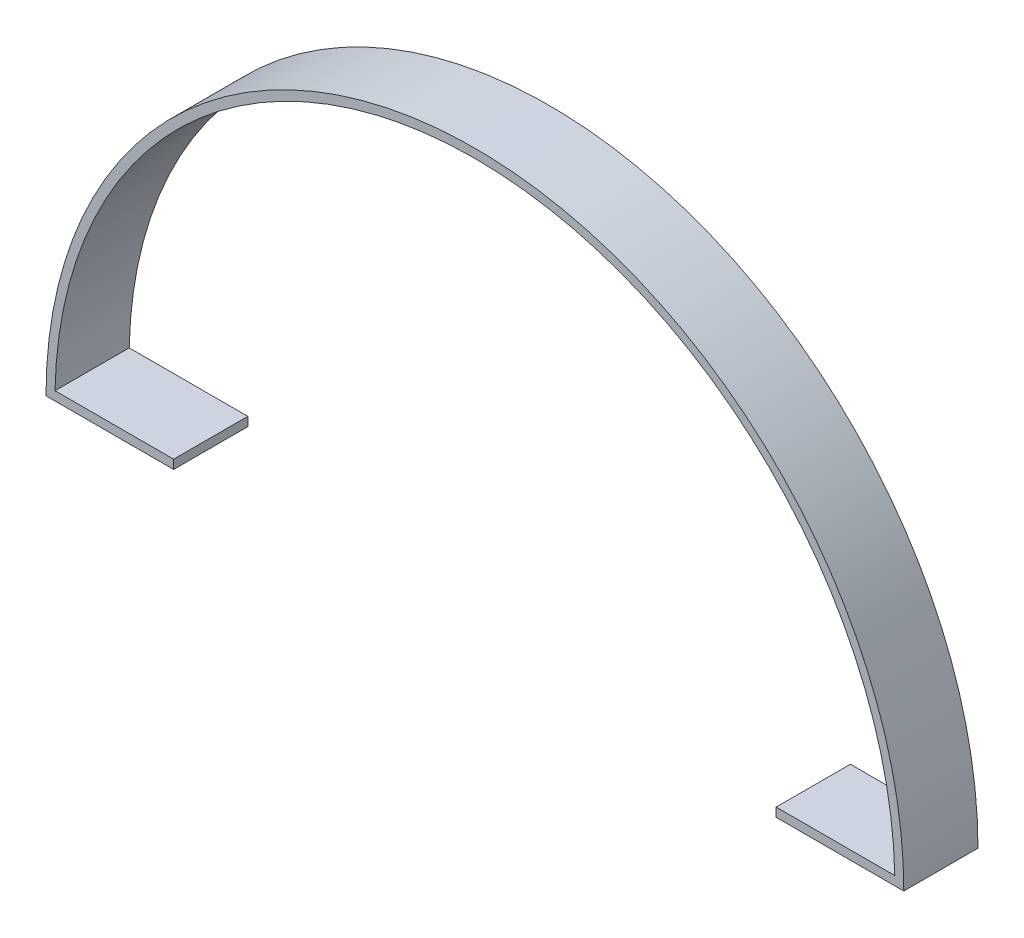
ISO-10303-21;
HEADER;
FILE_DESCRIPTION(('STEP AP214'),'2;1');
FILE_NAME('part.step','',(''),(''),'','','');
FILE_SCHEMA(('AUTOMOTIVE_DESIGN { 1 0 10303 214 1 1 1 1 }'));
ENDSEC;
DATA;
#1=APPLICATION_CONTEXT('core data for automotive mechanical design processes');
#2=APPLICATION_PROTOCOL_DEFINITION('international standard','automotive_design',2000,#1);
#3=PRODUCT_CONTEXT('',#1,'mechanical');
#4=PRODUCT('Part','Part','',(#3));
#5=PRODUCT_RELATED_PRODUCT_CATEGORY('part','',(#4));
#6=PRODUCT_DEFINITION_FORMATION('','',#4);
#7=PRODUCT_DEFINITION_CONTEXT('part definition',#1,'design');
#8=PRODUCT_DEFINITION('design','',#6,#7);
#9=PRODUCT_DEFINITION_SHAPE('','',#8);
#10=(LENGTH_UNIT() NAMED_UNIT(*) SI_UNIT(.MILLI.,.METRE.));
#11=(NAMED_UNIT(*) PLANE_ANGLE_UNIT() SI_UNIT($,.RADIAN.));
#12=(NAMED_UNIT(*) SI_UNIT($,.STERADIAN.) SOLID_ANGLE_UNIT());
#13=UNCERTAINTY_MEASURE_WITH_UNIT(LENGTH_MEASURE(1.E-05),#10,'distance_accuracy_value','');
#14=(GEOMETRIC_REPRESENTATION_CONTEXT(3) GLOBAL_UNCERTAINTY_ASSIGNED_CONTEXT((#13)) GLOBAL_UNIT_ASSIGNED_CONTEXT((#10,
#11,#12)) REPRESENTATION_CONTEXT('',''));
#15=CARTESIAN_POINT('',(0.,0.,0.));
#16=DIRECTION('',(0.,0.,1.));
#17=DIRECTION('',(1.,0.,0.));
#18=AXIS2_PLACEMENT_3D('',#15,#16,#17);
#19=CARTESIAN_POINT('',(289.,3.,25.));
#20=DIRECTION('',(0.,-1.,0.));
#21=DIRECTION('',(1.,0.,0.));
#22=AXIS2_PLACEMENT_3D('',#19,#20,#21);
#23=PLANE('',#22);
#24=DIRECTION('',(-1.,0.,0.));
#25=VECTOR('',#24,1.);
#26=CARTESIAN_POINT('',(289.,3.,0.));
#27=LINE('',#26,#25);
#28=CARTESIAN_POINT('',(285.968194305293,3.,0.));
#29=VERTEX_POINT('',#28);
#30=CARTESIAN_POINT('',(246.,3.,0.));
#31=VERTEX_POINT('',#30);
#32=EDGE_CURVE('E130',#29,#31,#27,.T.);
#33=ORIENTED_EDGE('',*,*,#32,.T.);
#34=DIRECTION('',(0.,0.,-1.));
#35=VECTOR('',#34,1.);
#36=CARTESIAN_POINT('',(246.,3.,25.));
#37=LINE('',#36,#35);
#38=CARTESIAN_POINT('',(246.,3.,25.));
#39=VERTEX_POINT('',#38);
#40=EDGE_CURVE('E11',#39,#31,#37,.T.);
#41=ORIENTED_EDGE('',*,*,#40,.F.);
#42=DIRECTION('',(-1.,0.,0.));
#43=VECTOR('',#42,1.);
#44=CARTESIAN_POINT('',(289.,3.,25.));
#45=LINE('',#44,#43);
#46=CARTESIAN_POINT('',(285.968194305293,3.,25.));
#47=VERTEX_POINT('',#46);
#48=EDGE_CURVE('E88',#47,#39,#45,.T.);
#49=ORIENTED_EDGE('',*,*,#48,.F.);
#50=DIRECTION('',(0.,0.,-1.));
#51=VECTOR('',#50,1.);
#52=CARTESIAN_POINT('',(285.968194305293,3.,25.));
#53=LINE('',#52,#51);
#54=EDGE_CURVE('E129',#47,#29,#53,.T.);
#55=ORIENTED_EDGE('',*,*,#54,.T.);
#56=EDGE_LOOP('',(#33,#41,#49,#55));
#57=FACE_BOUND('',#56,.T.);
#58=ADVANCED_FACE('F33',(#57),#23,.F.);
#59=CARTESIAN_POINT('',(246.,0.,25.));
#60=DIRECTION('',(-1.,0.,0.));
#61=DIRECTION('',(0.,0.,1.));
#62=AXIS2_PLACEMENT_3D('',#59,#60,#61);
#63=PLANE('',#62);
#64=DIRECTION('',(0.,1.,0.));
#65=VECTOR('',#64,1.);
#66=CARTESIAN_POINT('',(246.,0.,0.));
#67=LINE('',#66,#65);
#68=CARTESIAN_POINT('',(246.,0.,0.));
#69=VERTEX_POINT('',#68);
#70=EDGE_CURVE('E133',#69,#31,#67,.T.);
#71=ORIENTED_EDGE('',*,*,#70,.F.);
#72=DIRECTION('',(0.,0.,-1.));
#73=VECTOR('',#72,1.);
#74=CARTESIAN_POINT('',(246.,0.,25.));
#75=LINE('',#74,#73);
#76=CARTESIAN_POINT('',(246.,0.,25.));
#77=VERTEX_POINT('',#76);
#78=EDGE_CURVE('E41',#77,#69,#75,.T.);
#79=ORIENTED_EDGE('',*,*,#78,.F.);
#80=DIRECTION('',(0.,1.,0.));
#81=VECTOR('',#80,1.);
#82=CARTESIAN_POINT('',(246.,0.,25.));
#83=LINE('',#82,#81);
#84=EDGE_CURVE('E172',#77,#39,#83,.T.);
#85=ORIENTED_EDGE('',*,*,#84,.T.);
#86=ORIENTED_EDGE('',*,*,#40,.T.);
#87=EDGE_LOOP('',(#71,#79,#85,#86));
#88=FACE_BOUND('',#87,.T.);
#89=ADVANCED_FACE('F163',(#88),#63,.T.);
#90=CARTESIAN_POINT('',(289.,0.,25.));
#91=DIRECTION('',(0.,-1.,0.));
#92=DIRECTION('',(1.,0.,0.));
#93=AXIS2_PLACEMENT_3D('',#90,#91,#92);
#94=PLANE('',#93);
#95=DIRECTION('',(-1.,0.,0.));
#96=VECTOR('',#95,1.);
#97=CARTESIAN_POINT('',(289.,0.,0.));
#98=LINE('',#97,#96);
#99=CARTESIAN_POINT('',(289.,0.,0.));
#100=VERTEX_POINT('',#99);
#101=EDGE_CURVE('E136',#100,#69,#98,.T.);
#102=ORIENTED_EDGE('',*,*,#101,.F.);
#103=DIRECTION('',(0.,0.,-1.));
#104=VECTOR('',#103,1.);
#105=CARTESIAN_POINT('',(289.,0.,25.));
#106=LINE('',#105,#104);
#107=CARTESIAN_POINT('',(289.,0.,25.));
#108=VERTEX_POINT('',#107);
#109=EDGE_CURVE('E153',#108,#100,#106,.T.);
#110=ORIENTED_EDGE('',*,*,#109,.F.);
#111=DIRECTION('',(-1.,0.,0.));
#112=VECTOR('',#111,1.);
#113=CARTESIAN_POINT('',(289.,0.,25.));
#114=LINE('',#113,#112);
#115=EDGE_CURVE('E160',#108,#77,#114,.T.);
#116=ORIENTED_EDGE('',*,*,#115,.T.);
#117=ORIENTED_EDGE('',*,*,#78,.T.);
#118=EDGE_LOOP('',(#102,#110,#116,#117));
#119=FACE_BOUND('',#118,.T.);
#120=ADVANCED_FACE('F158',(#119),#94,.T.);
#121=CARTESIAN_POINT('',(144.5,0.,25.));
#122=DIRECTION('',(0.,0.,-1.));
#123=DIRECTION('',(-1.,0.,0.));
#124=AXIS2_PLACEMENT_3D('',#121,#122,#123);
#125=CYLINDRICAL_SURFACE('',#124,144.5);
#126=CARTESIAN_POINT('',(144.5,0.,0.));
#127=DIRECTION('',(0.,0.,-1.));
#128=DIRECTION('',(-1.,0.,0.));
#129=AXIS2_PLACEMENT_3D('',#126,#127,#128);
#130=CIRCLE('',#129,144.5);
#131=CARTESIAN_POINT('',(0.,0.,0.));
#132=VERTEX_POINT('',#131);
#133=EDGE_CURVE('E139',#132,#100,#130,.T.);
#134=ORIENTED_EDGE('',*,*,#133,.F.);
#135=DIRECTION('',(0.,0.,-1.));
#136=VECTOR('',#135,1.);
#137=CARTESIAN_POINT('',(0.,0.,25.));
#138=LINE('',#137,#136);
#139=CARTESIAN_POINT('',(0.,0.,25.));
#140=VERTEX_POINT('',#139);
#141=EDGE_CURVE('E151',#140,#132,#138,.T.);
#142=ORIENTED_EDGE('',*,*,#141,.F.);
#143=CARTESIAN_POINT('',(144.5,0.,25.));
#144=DIRECTION('',(0.,0.,-1.));
#145=DIRECTION('',(-1.,0.,0.));
#146=AXIS2_PLACEMENT_3D('',#143,#144,#145);
#147=CIRCLE('',#146,144.5);
#148=EDGE_CURVE('E124',#140,#108,#147,.T.);
#149=ORIENTED_EDGE('',*,*,#148,.T.);
#150=ORIENTED_EDGE('',*,*,#109,.T.);
#151=EDGE_LOOP('',(#134,#142,#149,#150));
#152=FACE_BOUND('',#151,.T.);
#153=ADVANCED_FACE('F170',(#152),#125,.T.);
#154=CARTESIAN_POINT('',(0.,0.,25.));
#155=DIRECTION('',(0.,-1.,0.));
#156=DIRECTION('',(0.,0.,-1.));
#157=AXIS2_PLACEMENT_3D('',#154,#155,#156);
#158=PLANE('',#157);
#159=DIRECTION('',(-1.,0.,0.));
#160=VECTOR('',#159,1.);
#161=CARTESIAN_POINT('',(0.,0.,0.));
#162=LINE('',#161,#160);
#163=CARTESIAN_POINT('',(43.,0.,0.));
#164=VERTEX_POINT('',#163);
#165=EDGE_CURVE('E142',#164,#132,#162,.T.);
#166=ORIENTED_EDGE('',*,*,#165,.F.);
#167=DIRECTION('',(0.,0.,-1.));
#168=VECTOR('',#167,1.);
#169=CARTESIAN_POINT('',(43.,0.,25.));
#170=LINE('',#169,#168);
#171=CARTESIAN_POINT('',(43.,0.,25.));
#172=VERTEX_POINT('',#171);
#173=EDGE_CURVE('E112',#172,#164,#170,.T.);
#174=ORIENTED_EDGE('',*,*,#173,.F.);
#175=DIRECTION('',(-1.,0.,0.));
#176=VECTOR('',#175,1.);
#177=CARTESIAN_POINT('',(0.,0.,25.));
#178=LINE('',#177,#176);
#179=EDGE_CURVE('E122',#172,#140,#178,.T.);
#180=ORIENTED_EDGE('',*,*,#179,.T.);
#181=ORIENTED_EDGE('',*,*,#141,.T.);
#182=EDGE_LOOP('',(#166,#174,#180,#181));
#183=FACE_BOUND('',#182,.T.);
#184=ADVANCED_FACE('F177',(#183),#158,.T.);
#185=CARTESIAN_POINT('',(43.,3.,25.));
#186=DIRECTION('',(1.,0.,0.));
#187=DIRECTION('',(0.,0.,-1.));
#188=AXIS2_PLACEMENT_3D('',#185,#186,#187);
#189=PLANE('',#188);
#190=DIRECTION('',(0.,-1.,0.));
#191=VECTOR('',#190,1.);
#192=CARTESIAN_POINT('',(43.,3.,0.));
#193=LINE('',#192,#191);
#194=CARTESIAN_POINT('',(43.,3.,0.));
#195=VERTEX_POINT('',#194);
#196=EDGE_CURVE('E111',#195,#164,#193,.T.);
#197=ORIENTED_EDGE('',*,*,#196,.F.);
#198=DIRECTION('',(0.,0.,-1.));
#199=VECTOR('',#198,1.);
#200=CARTESIAN_POINT('',(43.,3.,25.));
#201=LINE('',#200,#199);
#202=CARTESIAN_POINT('',(43.,3.,25.));
#203=VERTEX_POINT('',#202);
#204=EDGE_CURVE('E105',#203,#195,#201,.T.);
#205=ORIENTED_EDGE('',*,*,#204,.F.);
#206=DIRECTION('',(0.,-1.,0.));
#207=VECTOR('',#206,1.);
#208=CARTESIAN_POINT('',(43.,3.,25.));
#209=LINE('',#208,#207);
#210=EDGE_CURVE('E109',#203,#172,#209,.T.);
#211=ORIENTED_EDGE('',*,*,#210,.T.);
#212=ORIENTED_EDGE('',*,*,#173,.T.);
#213=EDGE_LOOP('',(#197,#205,#211,#212));
#214=FACE_BOUND('',#213,.T.);
#215=ADVANCED_FACE('F107',(#214),#189,.T.);
#216=CARTESIAN_POINT('',(0.,3.,25.));
#217=DIRECTION('',(0.,-1.,0.));
#218=DIRECTION('',(0.,0.,-1.));
#219=AXIS2_PLACEMENT_3D('',#216,#217,#218);
#220=PLANE('',#219);
#221=DIRECTION('',(1.,0.,0.));
#222=VECTOR('',#221,1.);
#223=CARTESIAN_POINT('',(0.,3.,0.));
#224=LINE('',#223,#222);
#225=CARTESIAN_POINT('',(3.03180569470748,3.,0.));
#226=VERTEX_POINT('',#225);
#227=EDGE_CURVE('E76',#195,#226,#224,.F.);
#228=ORIENTED_EDGE('',*,*,#227,.T.);
#229=DIRECTION('',(0.,0.,-1.));
#230=VECTOR('',#229,1.);
#231=CARTESIAN_POINT('',(3.03180569470748,3.,25.));
#232=LINE('',#231,#230);
#233=CARTESIAN_POINT('',(3.03180569470748,3.,25.));
#234=VERTEX_POINT('',#233);
#235=EDGE_CURVE('E113',#234,#226,#232,.T.);
#236=ORIENTED_EDGE('',*,*,#235,.F.);
#237=DIRECTION('',(1.,0.,0.));
#238=VECTOR('',#237,1.);
#239=CARTESIAN_POINT('',(0.,3.,25.));
#240=LINE('',#239,#238);
#241=EDGE_CURVE('E115',#203,#234,#240,.F.);
#242=ORIENTED_EDGE('',*,*,#241,.F.);
#243=ORIENTED_EDGE('',*,*,#204,.T.);
#244=EDGE_LOOP('',(#228,#236,#242,#243));
#245=FACE_BOUND('',#244,.T.);
#246=ADVANCED_FACE('F116',(#245),#220,.F.);
#247=CARTESIAN_POINT('',(144.5,0.,25.));
#248=DIRECTION('',(0.,0.,-1.));
#249=DIRECTION('',(-1.,0.,0.));
#250=AXIS2_PLACEMENT_3D('',#247,#248,#249);
#251=CYLINDRICAL_SURFACE('',#250,141.5);
#252=CARTESIAN_POINT('',(144.5,0.,0.));
#253=DIRECTION('',(0.,0.,1.));
#254=DIRECTION('',(1.,0.,0.));
#255=AXIS2_PLACEMENT_3D('',#252,#253,#254);
#256=CIRCLE('',#255,141.5);
#257=EDGE_CURVE('E82',#226,#29,#256,.F.);
#258=ORIENTED_EDGE('',*,*,#257,.T.);
#259=ORIENTED_EDGE('',*,*,#54,.F.);
#260=CARTESIAN_POINT('',(144.5,0.,25.));
#261=DIRECTION('',(0.,0.,1.));
#262=DIRECTION('',(1.,0.,0.));
#263=AXIS2_PLACEMENT_3D('',#260,#261,#262);
#264=CIRCLE('',#263,141.5);
#265=EDGE_CURVE('E49',#234,#47,#264,.F.);
#266=ORIENTED_EDGE('',*,*,#265,.F.);
#267=ORIENTED_EDGE('',*,*,#235,.T.);
#268=EDGE_LOOP('',(#258,#259,#266,#267));
#269=FACE_BOUND('',#268,.T.);
#270=ADVANCED_FACE('F179',(#269),#251,.F.);
#271=CARTESIAN_POINT('',(144.5,0.,25.));
#272=DIRECTION('',(0.,0.,-1.));
#273=DIRECTION('',(-1.,0.,0.));
#274=AXIS2_PLACEMENT_3D('',#271,#272,#273);
#275=PLANE('',#274);
#276=ORIENTED_EDGE('',*,*,#48,.T.);
#277=ORIENTED_EDGE('',*,*,#84,.F.);
#278=ORIENTED_EDGE('',*,*,#115,.F.);
#279=ORIENTED_EDGE('',*,*,#148,.F.);
#280=ORIENTED_EDGE('',*,*,#179,.F.);
#281=ORIENTED_EDGE('',*,*,#210,.F.);
#282=ORIENTED_EDGE('',*,*,#241,.T.);
#283=ORIENTED_EDGE('',*,*,#265,.T.);
#284=EDGE_LOOP('',(#276,#277,#278,#279,#280,#281,#282,#283));
#285=FACE_BOUND('',#284,.T.);
#286=ADVANCED_FACE('F119',(#285),#275,.F.);
#287=CARTESIAN_POINT('',(144.5,0.,0.));
#288=DIRECTION('',(0.,0.,-1.));
#289=DIRECTION('',(-1.,0.,0.));
#290=AXIS2_PLACEMENT_3D('',#287,#288,#289);
#291=PLANE('',#290);
#292=ORIENTED_EDGE('',*,*,#32,.F.);
#293=ORIENTED_EDGE('',*,*,#257,.F.);
#294=ORIENTED_EDGE('',*,*,#227,.F.);
#295=ORIENTED_EDGE('',*,*,#196,.T.);
#296=ORIENTED_EDGE('',*,*,#165,.T.);
#297=ORIENTED_EDGE('',*,*,#133,.T.);
#298=ORIENTED_EDGE('',*,*,#101,.T.);
#299=ORIENTED_EDGE('',*,*,#70,.T.);
#300=EDGE_LOOP('',(#292,#293,#294,#295,#296,#297,#298,#299));
#301=FACE_BOUND('',#300,.T.);
#302=ADVANCED_FACE('F166',(#301),#291,.T.);
#303=CLOSED_SHELL('',(#58,#89,#120,#153,#184,#215,#246,#270,#286,#302));
#304=MANIFOLD_SOLID_BREP('B2',#303);
#305=ADVANCED_BREP_SHAPE_REPRESENTATION('',(#18,#304),#14);
#306=SHAPE_DEFINITION_REPRESENTATION(#9,#305);
ENDSEC;
END-ISO-10303-21;
